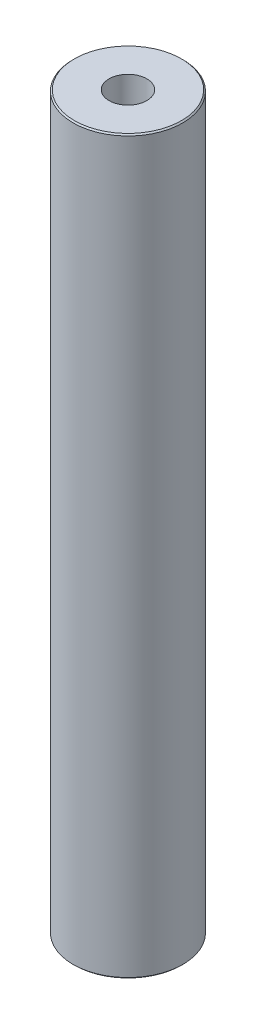
ISO-10303-21;
HEADER;
FILE_DESCRIPTION(('STEP AP214'),'2;1');
FILE_NAME('part.step','',(''),(''),'','','');
FILE_SCHEMA(('AUTOMOTIVE_DESIGN { 1 0 10303 214 1 1 1 1 }'));
ENDSEC;
DATA;
#1=APPLICATION_CONTEXT('core data for automotive mechanical design processes');
#2=APPLICATION_PROTOCOL_DEFINITION('international standard','automotive_design',2000,#1);
#3=PRODUCT_CONTEXT('',#1,'mechanical');
#4=PRODUCT('Part','Part','',(#3));
#5=PRODUCT_RELATED_PRODUCT_CATEGORY('part','',(#4));
#6=PRODUCT_DEFINITION_FORMATION('','',#4);
#7=PRODUCT_DEFINITION_CONTEXT('part definition',#1,'design');
#8=PRODUCT_DEFINITION('design','',#6,#7);
#9=PRODUCT_DEFINITION_SHAPE('','',#8);
#10=(LENGTH_UNIT() NAMED_UNIT(*) SI_UNIT(.MILLI.,.METRE.));
#11=(NAMED_UNIT(*) PLANE_ANGLE_UNIT() SI_UNIT($,.RADIAN.));
#12=(NAMED_UNIT(*) SI_UNIT($,.STERADIAN.) SOLID_ANGLE_UNIT());
#13=UNCERTAINTY_MEASURE_WITH_UNIT(LENGTH_MEASURE(1.E-05),#10,'distance_accuracy_value','');
#14=(GEOMETRIC_REPRESENTATION_CONTEXT(3) GLOBAL_UNCERTAINTY_ASSIGNED_CONTEXT((#13)) GLOBAL_UNIT_ASSIGNED_CONTEXT((#10,
#11,#12)) REPRESENTATION_CONTEXT('',''));
#15=CARTESIAN_POINT('',(0.,0.,0.));
#16=DIRECTION('',(0.,0.,1.));
#17=DIRECTION('',(1.,0.,0.));
#18=AXIS2_PLACEMENT_3D('',#15,#16,#17);
#19=CARTESIAN_POINT('',(0.,600.,0.));
#20=DIRECTION('',(0.,-1.,0.));
#21=DIRECTION('',(0.,0.,-1.));
#22=AXIS2_PLACEMENT_3D('',#19,#20,#21);
#23=CYLINDRICAL_SURFACE('',#22,45.);
#24=CARTESIAN_POINT('',(0.,598.928917383124,0.));
#25=DIRECTION('',(0.,1.,0.));
#26=DIRECTION('',(0.,0.,1.));
#27=AXIS2_PLACEMENT_3D('',#24,#25,#26);
#28=CIRCLE('',#27,45.);
#29=CARTESIAN_POINT('',(0.,598.928917383124,45.));
#30=VERTEX_POINT('',#29);
#31=EDGE_CURVE('E50',#30,#30,#28,.F.);
#32=ORIENTED_EDGE('',*,*,#31,.T.);
#33=EDGE_LOOP('',(#32));
#34=FACE_BOUND('',#33,.T.);
#35=CARTESIAN_POINT('',(0.,1.07108261687605,0.));
#36=DIRECTION('',(0.,1.,0.));
#37=DIRECTION('',(0.,0.,1.));
#38=AXIS2_PLACEMENT_3D('',#35,#36,#37);
#39=CIRCLE('',#38,45.);
#40=CARTESIAN_POINT('',(0.,1.07108261687605,45.));
#41=VERTEX_POINT('',#40);
#42=EDGE_CURVE('E51',#41,#41,#39,.T.);
#43=ORIENTED_EDGE('',*,*,#42,.T.);
#44=EDGE_LOOP('',(#43));
#45=FACE_BOUND('',#44,.T.);
#46=ADVANCED_FACE('F39',(#34,#45),#23,.T.);
#47=CARTESIAN_POINT('',(0.,600.,0.));
#48=DIRECTION('',(0.,1.,0.));
#49=DIRECTION('',(0.,0.,1.));
#50=AXIS2_PLACEMENT_3D('',#47,#48,#49);
#51=PLANE('',#50);
#52=CARTESIAN_POINT('',(0.,600.,0.));
#53=DIRECTION('',(0.,1.,0.));
#54=DIRECTION('',(0.,0.,1.));
#55=AXIS2_PLACEMENT_3D('',#52,#53,#54);
#56=CIRCLE('',#55,43.9289173831241);
#57=CARTESIAN_POINT('',(0.,600.,43.9289173831241));
#58=VERTEX_POINT('',#57);
#59=EDGE_CURVE('E54',#58,#58,#56,.T.);
#60=ORIENTED_EDGE('',*,*,#59,.T.);
#61=EDGE_LOOP('',(#60));
#62=FACE_BOUND('',#61,.T.);
#63=CARTESIAN_POINT('',(0.,600.,0.));
#64=DIRECTION('',(0.,1.,0.));
#65=DIRECTION('',(0.,0.,1.));
#66=AXIS2_PLACEMENT_3D('',#63,#64,#65);
#67=CIRCLE('',#66,15.5058743861032);
#68=CARTESIAN_POINT('',(0.,600.,15.5058743861032));
#69=VERTEX_POINT('',#68);
#70=EDGE_CURVE('E58',#69,#69,#67,.T.);
#71=ORIENTED_EDGE('',*,*,#70,.F.);
#72=EDGE_LOOP('',(#71));
#73=FACE_BOUND('',#72,.T.);
#74=ADVANCED_FACE('F69',(#62,#73),#51,.T.);
#75=CARTESIAN_POINT('',(0.,0.,0.));
#76=DIRECTION('',(0.,1.,0.));
#77=DIRECTION('',(0.,0.,1.));
#78=AXIS2_PLACEMENT_3D('',#75,#76,#77);
#79=PLANE('',#78);
#80=CARTESIAN_POINT('',(0.,0.,0.));
#81=DIRECTION('',(0.,1.,0.));
#82=DIRECTION('',(0.,0.,1.));
#83=AXIS2_PLACEMENT_3D('',#80,#81,#82);
#84=CIRCLE('',#83,43.9289173831239);
#85=CARTESIAN_POINT('',(0.,0.,43.9289173831239));
#86=VERTEX_POINT('',#85);
#87=EDGE_CURVE('E10',#86,#86,#84,.F.);
#88=ORIENTED_EDGE('',*,*,#87,.T.);
#89=EDGE_LOOP('',(#88));
#90=FACE_BOUND('',#89,.T.);
#91=CARTESIAN_POINT('',(0.,0.,0.));
#92=DIRECTION('',(0.,1.,0.));
#93=DIRECTION('',(0.,0.,1.));
#94=AXIS2_PLACEMENT_3D('',#91,#92,#93);
#95=CIRCLE('',#94,15.5058743861032);
#96=CARTESIAN_POINT('',(0.,0.,15.5058743861032));
#97=VERTEX_POINT('',#96);
#98=EDGE_CURVE('E63',#97,#97,#95,.T.);
#99=ORIENTED_EDGE('',*,*,#98,.T.);
#100=EDGE_LOOP('',(#99));
#101=FACE_BOUND('',#100,.T.);
#102=ADVANCED_FACE('F75',(#90,#101),#79,.F.);
#103=CARTESIAN_POINT('',(0.,600.,0.));
#104=DIRECTION('',(0.,-1.,0.));
#105=DIRECTION('',(0.,0.,-1.));
#106=AXIS2_PLACEMENT_3D('',#103,#104,#105);
#107=CYLINDRICAL_SURFACE('',#106,15.5058743861032);
#108=ORIENTED_EDGE('',*,*,#70,.T.);
#109=EDGE_LOOP('',(#108));
#110=FACE_BOUND('',#109,.T.);
#111=ORIENTED_EDGE('',*,*,#98,.F.);
#112=EDGE_LOOP('',(#111));
#113=FACE_BOUND('',#112,.T.);
#114=ADVANCED_FACE('F70',(#110,#113),#107,.F.);
#115=CARTESIAN_POINT('',(0.,600.,0.));
#116=DIRECTION('',(0.,-1.,0.));
#117=DIRECTION('',(0.,0.,-1.));
#118=AXIS2_PLACEMENT_3D('',#115,#116,#117);
#119=CONICAL_SURFACE('',#118,43.9289173831241,0.78539816339738);
#120=ORIENTED_EDGE('',*,*,#31,.F.);
#121=EDGE_LOOP('',(#120));
#122=FACE_BOUND('',#121,.T.);
#123=ORIENTED_EDGE('',*,*,#59,.F.);
#124=EDGE_LOOP('',(#123));
#125=FACE_BOUND('',#124,.T.);
#126=ADVANCED_FACE('F81',(#122,#125),#119,.T.);
#127=CARTESIAN_POINT('',(0.,1.07108261687605,0.));
#128=DIRECTION('',(0.,1.,0.));
#129=DIRECTION('',(0.,0.,1.));
#130=AXIS2_PLACEMENT_3D('',#127,#128,#129);
#131=CONICAL_SURFACE('',#130,45.,0.785398163397461);
#132=ORIENTED_EDGE('',*,*,#87,.F.);
#133=EDGE_LOOP('',(#132));
#134=FACE_BOUND('',#133,.T.);
#135=ORIENTED_EDGE('',*,*,#42,.F.);
#136=EDGE_LOOP('',(#135));
#137=FACE_BOUND('',#136,.T.);
#138=ADVANCED_FACE('F45',(#134,#137),#131,.T.);
#139=CLOSED_SHELL('',(#46,#74,#102,#114,#126,#138));
#140=MANIFOLD_SOLID_BREP('B2',#139);
#141=ADVANCED_BREP_SHAPE_REPRESENTATION('',(#18,#140),#14);
#142=SHAPE_DEFINITION_REPRESENTATION(#9,#141);
ENDSEC;
END-ISO-10303-21;
